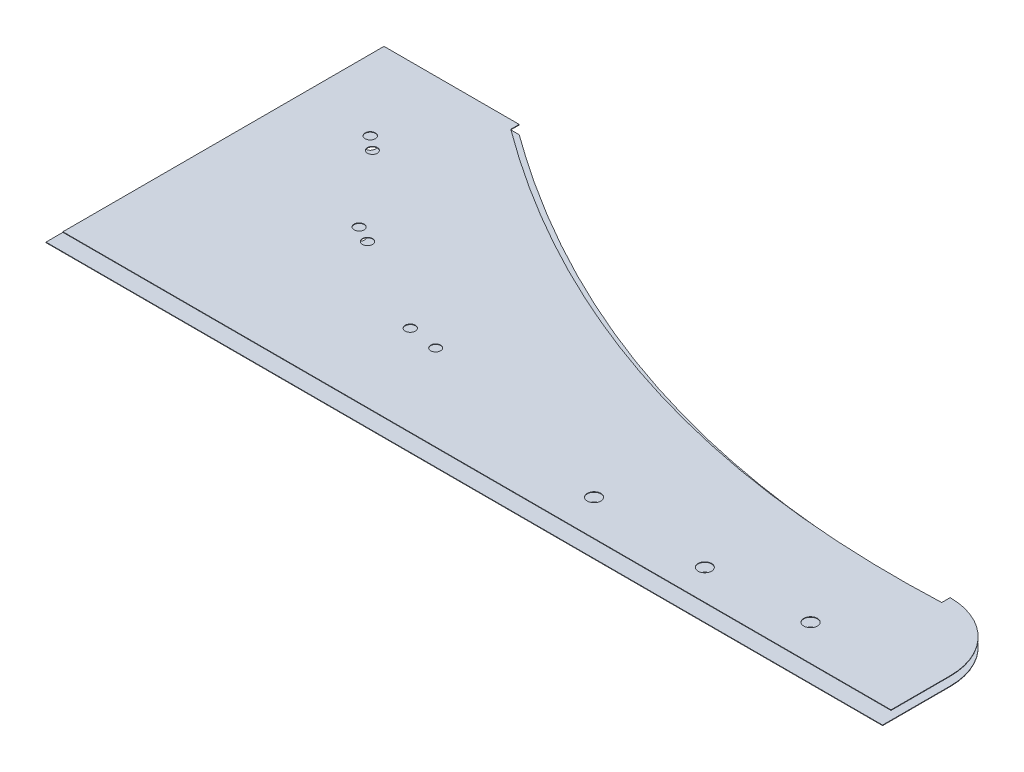
ISO-10303-21;
HEADER;
FILE_DESCRIPTION(('STEP AP214'),'2;1');
FILE_NAME('part.step','',(''),(''),'','','');
FILE_SCHEMA(('AUTOMOTIVE_DESIGN { 1 0 10303 214 1 1 1 1 }'));
ENDSEC;
DATA;
#1=APPLICATION_CONTEXT('core data for automotive mechanical design processes');
#2=APPLICATION_PROTOCOL_DEFINITION('international standard','automotive_design',2000,#1);
#3=PRODUCT_CONTEXT('',#1,'mechanical');
#4=PRODUCT('Part','Part','',(#3));
#5=PRODUCT_RELATED_PRODUCT_CATEGORY('part','',(#4));
#6=PRODUCT_DEFINITION_FORMATION('','',#4);
#7=PRODUCT_DEFINITION_CONTEXT('part definition',#1,'design');
#8=PRODUCT_DEFINITION('design','',#6,#7);
#9=PRODUCT_DEFINITION_SHAPE('','',#8);
#10=(LENGTH_UNIT() NAMED_UNIT(*) SI_UNIT(.MILLI.,.METRE.));
#11=(NAMED_UNIT(*) PLANE_ANGLE_UNIT() SI_UNIT($,.RADIAN.));
#12=(NAMED_UNIT(*) SI_UNIT($,.STERADIAN.) SOLID_ANGLE_UNIT());
#13=UNCERTAINTY_MEASURE_WITH_UNIT(LENGTH_MEASURE(1.E-05),#10,'distance_accuracy_value','');
#14=(GEOMETRIC_REPRESENTATION_CONTEXT(3) GLOBAL_UNCERTAINTY_ASSIGNED_CONTEXT((#13)) GLOBAL_UNIT_ASSIGNED_CONTEXT((#10,
#11,#12)) REPRESENTATION_CONTEXT('',''));
#15=CARTESIAN_POINT('',(0.,0.,0.));
#16=DIRECTION('',(0.,0.,1.));
#17=DIRECTION('',(1.,0.,0.));
#18=AXIS2_PLACEMENT_3D('',#15,#16,#17);
#19=CARTESIAN_POINT('',(-436.202986930584,699.7,-432.681641880523));
#20=DIRECTION('',(-7.9019274698049E-10,0.,1.));
#21=DIRECTION('',(-1.,0.,-7.9019274698049E-10));
#22=AXIS2_PLACEMENT_3D('',#19,#20,#21);
#23=PLANE('',#22);
#24=DIRECTION('',(-1.,0.,-7.9019274698049E-10));
#25=VECTOR('',#24,1.);
#26=CARTESIAN_POINT('',(-436.202986930584,700.,-432.681641880523));
#27=LINE('',#26,#25);
#28=CARTESIAN_POINT('',(-436.202986838529,700.,-432.681641813376));
#29=VERTEX_POINT('',#28);
#30=CARTESIAN_POINT('',(-521.202987022629,700.,-432.681641947689));
#31=VERTEX_POINT('',#30);
#32=EDGE_CURVE('E135',#29,#31,#27,.T.);
#33=ORIENTED_EDGE('',*,*,#32,.F.);
#34=DIRECTION('',(0.,1.,0.));
#35=VECTOR('',#34,1.);
#36=CARTESIAN_POINT('',(-436.202986838529,699.7,-432.681641813376));
#37=LINE('',#36,#35);
#38=CARTESIAN_POINT('',(-436.202986838529,699.7,-432.681641813376));
#39=VERTEX_POINT('',#38);
#40=EDGE_CURVE('E134',#39,#29,#37,.T.);
#41=ORIENTED_EDGE('',*,*,#40,.F.);
#42=DIRECTION('',(-1.,0.,-7.9019274698049E-10));
#43=VECTOR('',#42,1.);
#44=CARTESIAN_POINT('',(-436.202986930584,699.7,-432.681641880523));
#45=LINE('',#44,#43);
#46=CARTESIAN_POINT('',(-521.202987022629,699.7,-432.681641947689));
#47=VERTEX_POINT('',#46);
#48=EDGE_CURVE('E170',#39,#47,#45,.T.);
#49=ORIENTED_EDGE('',*,*,#48,.T.);
#50=DIRECTION('',(0.,1.,0.));
#51=VECTOR('',#50,1.);
#52=CARTESIAN_POINT('',(-521.202987022629,699.7,-432.681641947689));
#53=LINE('',#52,#51);
#54=EDGE_CURVE('E12',#47,#31,#53,.T.);
#55=ORIENTED_EDGE('',*,*,#54,.T.);
#56=EDGE_LOOP('',(#33,#41,#49,#55));
#57=FACE_BOUND('',#56,.T.);
#58=ADVANCED_FACE('F47',(#57),#23,.F.);
#59=CARTESIAN_POINT('',(-521.202987022629,699.7,-432.681641947689));
#60=DIRECTION('',(1.,0.,0.));
#61=DIRECTION('',(0.,0.,1.));
#62=AXIS2_PLACEMENT_3D('',#59,#60,#61);
#63=PLANE('',#62);
#64=DIRECTION('',(0.,0.,1.));
#65=VECTOR('',#64,1.);
#66=CARTESIAN_POINT('',(-521.202987022629,700.,-432.681641947689));
#67=LINE('',#66,#65);
#68=CARTESIAN_POINT('',(-521.202987022629,700.,-237.681641947689));
#69=VERTEX_POINT('',#68);
#70=EDGE_CURVE('E163',#31,#69,#67,.T.);
#71=ORIENTED_EDGE('',*,*,#70,.F.);
#72=ORIENTED_EDGE('',*,*,#54,.F.);
#73=DIRECTION('',(0.,0.,1.));
#74=VECTOR('',#73,1.);
#75=CARTESIAN_POINT('',(-521.202987022629,699.7,-432.681641947689));
#76=LINE('',#75,#74);
#77=CARTESIAN_POINT('',(-521.202987022629,699.7,-237.681641947689));
#78=VERTEX_POINT('',#77);
#79=EDGE_CURVE('E97',#47,#78,#76,.T.);
#80=ORIENTED_EDGE('',*,*,#79,.T.);
#81=DIRECTION('',(0.,1.,0.));
#82=VECTOR('',#81,1.);
#83=CARTESIAN_POINT('',(-521.202987022629,699.7,-237.681641947689));
#84=LINE('',#83,#82);
#85=EDGE_CURVE('E56',#78,#69,#84,.T.);
#86=ORIENTED_EDGE('',*,*,#85,.T.);
#87=EDGE_LOOP('',(#71,#72,#80,#86));
#88=FACE_BOUND('',#87,.T.);
#89=ADVANCED_FACE('F153',(#88),#63,.F.);
#90=CARTESIAN_POINT('',(-521.202987022629,699.7,-237.681641947689));
#91=DIRECTION('',(0.,0.,-1.));
#92=DIRECTION('',(1.,0.,0.));
#93=AXIS2_PLACEMENT_3D('',#90,#91,#92);
#94=PLANE('',#93);
#95=DIRECTION('',(1.,0.,0.));
#96=VECTOR('',#95,1.);
#97=CARTESIAN_POINT('',(-521.202987022629,700.,-237.681641947689));
#98=LINE('',#97,#96);
#99=CARTESIAN_POINT('',(-26.2029870226295,700.,-237.681641947689));
#100=VERTEX_POINT('',#99);
#101=EDGE_CURVE('E167',#69,#100,#98,.T.);
#102=ORIENTED_EDGE('',*,*,#101,.F.);
#103=ORIENTED_EDGE('',*,*,#85,.F.);
#104=DIRECTION('',(1.,0.,0.));
#105=VECTOR('',#104,1.);
#106=CARTESIAN_POINT('',(-521.202987022629,699.7,-237.681641947689));
#107=LINE('',#106,#105);
#108=CARTESIAN_POINT('',(-26.2029870226295,699.7,-237.681641947689));
#109=VERTEX_POINT('',#108);
#110=EDGE_CURVE('E125',#78,#109,#107,.T.);
#111=ORIENTED_EDGE('',*,*,#110,.T.);
#112=DIRECTION('',(0.,1.,0.));
#113=VECTOR('',#112,1.);
#114=CARTESIAN_POINT('',(-26.2029870226295,699.7,-237.681641947689));
#115=LINE('',#114,#113);
#116=EDGE_CURVE('E119',#109,#100,#115,.T.);
#117=ORIENTED_EDGE('',*,*,#116,.T.);
#118=EDGE_LOOP('',(#102,#103,#111,#117));
#119=FACE_BOUND('',#118,.T.);
#120=ADVANCED_FACE('F151',(#119),#94,.F.);
#121=CARTESIAN_POINT('',(-26.2029870226295,699.7,-237.681641947689));
#122=DIRECTION('',(-1.,0.,0.));
#123=DIRECTION('',(0.,0.,-1.));
#124=AXIS2_PLACEMENT_3D('',#121,#122,#123);
#125=PLANE('',#124);
#126=DIRECTION('',(0.,0.,-1.));
#127=VECTOR('',#126,1.);
#128=CARTESIAN_POINT('',(-26.2029870226295,700.,-237.681641947689));
#129=LINE('',#128,#127);
#130=CARTESIAN_POINT('',(-26.2029870226294,700.,-277.681641947689));
#131=VERTEX_POINT('',#130);
#132=EDGE_CURVE('E212',#100,#131,#129,.T.);
#133=ORIENTED_EDGE('',*,*,#132,.F.);
#134=ORIENTED_EDGE('',*,*,#116,.F.);
#135=DIRECTION('',(0.,0.,-1.));
#136=VECTOR('',#135,1.);
#137=CARTESIAN_POINT('',(-26.2029870226295,699.7,-237.681641947689));
#138=LINE('',#137,#136);
#139=CARTESIAN_POINT('',(-26.2029870226294,699.7,-277.681641947689));
#140=VERTEX_POINT('',#139);
#141=EDGE_CURVE('E109',#109,#140,#138,.T.);
#142=ORIENTED_EDGE('',*,*,#141,.T.);
#143=DIRECTION('',(0.,1.,0.));
#144=VECTOR('',#143,1.);
#145=CARTESIAN_POINT('',(-26.2029870226294,699.7,-277.681641947689));
#146=LINE('',#145,#144);
#147=EDGE_CURVE('E114',#140,#131,#146,.T.);
#148=ORIENTED_EDGE('',*,*,#147,.T.);
#149=EDGE_LOOP('',(#133,#134,#142,#148));
#150=FACE_BOUND('',#149,.T.);
#151=ADVANCED_FACE('F122',(#150),#125,.F.);
#152=CARTESIAN_POINT('',(-66.2029870226294,699.7,-277.681641947689));
#153=DIRECTION('',(0.,1.,0.));
#154=DIRECTION('',(0.,0.,-1.));
#155=AXIS2_PLACEMENT_3D('',#152,#153,#154);
#156=CYLINDRICAL_SURFACE('',#155,40.);
#157=CARTESIAN_POINT('',(-66.2029870226294,700.,-277.681641947689));
#158=DIRECTION('',(0.,1.,0.));
#159=DIRECTION('',(0.,0.,1.));
#160=AXIS2_PLACEMENT_3D('',#157,#158,#159);
#161=CIRCLE('',#160,40.);
#162=CARTESIAN_POINT('',(-66.2029870226294,700.,-317.681641947689));
#163=VERTEX_POINT('',#162);
#164=EDGE_CURVE('E116',#131,#163,#161,.T.);
#165=ORIENTED_EDGE('',*,*,#164,.F.);
#166=ORIENTED_EDGE('',*,*,#147,.F.);
#167=CARTESIAN_POINT('',(-66.2029870226294,699.7,-277.681641947689));
#168=DIRECTION('',(0.,1.,0.));
#169=DIRECTION('',(0.,0.,1.));
#170=AXIS2_PLACEMENT_3D('',#167,#168,#169);
#171=CIRCLE('',#170,40.);
#172=CARTESIAN_POINT('',(-66.2029870226294,699.7,-317.681641947689));
#173=VERTEX_POINT('',#172);
#174=EDGE_CURVE('E105',#140,#173,#171,.T.);
#175=ORIENTED_EDGE('',*,*,#174,.T.);
#176=DIRECTION('',(0.,1.,0.));
#177=VECTOR('',#176,1.);
#178=CARTESIAN_POINT('',(-66.2029870226294,699.7,-317.681641947689));
#179=LINE('',#178,#177);
#180=EDGE_CURVE('E120',#173,#163,#179,.T.);
#181=ORIENTED_EDGE('',*,*,#180,.T.);
#182=EDGE_LOOP('',(#165,#166,#175,#181));
#183=FACE_BOUND('',#182,.T.);
#184=ADVANCED_FACE('F115',(#183),#156,.T.);
#185=CARTESIAN_POINT('',(243907.016921862,699.7,-970636.245329769));
#186=CARTESIAN_POINT('',(-212077.093758222,699.7,976969.386915229));
#187=CARTESIAN_POINT('',(179399.129928416,699.7,-984620.675822955));
#188=B_SPLINE_CURVE_WITH_KNOTS('',2,(#185,#186,#187),.UNSPECIFIED.,.F.,.F.,(3,3),(0.,1.),.UNSPECIFIED.);
#189=DIRECTION('',(0.,1.,0.));
#190=VECTOR('',#189,1.);
#191=SURFACE_OF_LINEAR_EXTRUSION('',#188,#190);
#192=CARTESIAN_POINT('',(243907.016921862,700.,-970636.245329769));
#193=CARTESIAN_POINT('',(-212077.093758222,700.,976969.386915229));
#194=CARTESIAN_POINT('',(179399.129928416,700.,-984620.675822955));
#195=B_SPLINE_CURVE_WITH_KNOTS('',2,(#192,#193,#194),.UNSPECIFIED.,.F.,.F.,(3,3),(0.,1.),.UNSPECIFIED.);
#196=EDGE_CURVE('E85',#163,#29,#195,.T.);
#197=ORIENTED_EDGE('',*,*,#196,.F.);
#198=ORIENTED_EDGE('',*,*,#180,.F.);
#199=EDGE_CURVE('E65',#173,#39,#188,.T.);
#200=ORIENTED_EDGE('',*,*,#199,.T.);
#201=ORIENTED_EDGE('',*,*,#40,.T.);
#202=EDGE_LOOP('',(#197,#198,#200,#201));
#203=FACE_BOUND('',#202,.T.);
#204=ADVANCED_FACE('F141',(#203),#191,.T.);
#205=CARTESIAN_POINT('',(-66.2029870226294,699.7,-277.681641947689));
#206=DIRECTION('',(0.,-1.,0.));
#207=DIRECTION('',(0.,0.,1.));
#208=AXIS2_PLACEMENT_3D('',#205,#206,#207);
#209=PLANE('',#208);
#210=CARTESIAN_POINT('',(-94.9095215443751,699.7,-263.802212935845));
#211=DIRECTION('',(0.,1.,0.));
#212=DIRECTION('',(0.,0.,1.));
#213=AXIS2_PLACEMENT_3D('',#210,#211,#212);
#214=CIRCLE('',#213,3.99999999999999);
#215=CARTESIAN_POINT('',(-94.9095215443751,699.7,-259.802212935845));
#216=VERTEX_POINT('',#215);
#217=EDGE_CURVE('E199',#216,#216,#214,.T.);
#218=ORIENTED_EDGE('',*,*,#217,.T.);
#219=EDGE_LOOP('',(#218));
#220=FACE_BOUND('',#219,.T.);
#221=CARTESIAN_POINT('',(-154.344703344319,699.7,-260.643821632466));
#222=DIRECTION('',(0.,1.,0.));
#223=DIRECTION('',(0.,0.,1.));
#224=AXIS2_PLACEMENT_3D('',#221,#222,#223);
#225=CIRCLE('',#224,4.00000000000002);
#226=CARTESIAN_POINT('',(-154.344703344319,699.7,-256.643821632466));
#227=VERTEX_POINT('',#226);
#228=EDGE_CURVE('E237',#227,#227,#225,.T.);
#229=ORIENTED_EDGE('',*,*,#228,.T.);
#230=EDGE_LOOP('',(#229));
#231=FACE_BOUND('',#230,.T.);
#232=CARTESIAN_POINT('',(-223.024834580686,699.7,-263.802212935845));
#233=DIRECTION('',(0.,1.,0.));
#234=DIRECTION('',(0.,0.,1.));
#235=AXIS2_PLACEMENT_3D('',#232,#233,#234);
#236=CIRCLE('',#235,4.00000000000002);
#237=CARTESIAN_POINT('',(-223.024834580686,699.7,-259.802212935845));
#238=VERTEX_POINT('',#237);
#239=EDGE_CURVE('E234',#238,#238,#236,.T.);
#240=ORIENTED_EDGE('',*,*,#239,.T.);
#241=EDGE_LOOP('',(#240));
#242=FACE_BOUND('',#241,.T.);
#243=CARTESIAN_POINT('',(-346.372819063942,699.7,-293.429327819401));
#244=DIRECTION('',(0.,1.,0.));
#245=DIRECTION('',(0.,0.,1.));
#246=AXIS2_PLACEMENT_3D('',#243,#244,#245);
#247=CIRCLE('',#246,2.94464183129883);
#248=CARTESIAN_POINT('',(-346.372819063942,699.7,-290.484685988103));
#249=VERTEX_POINT('',#248);
#250=EDGE_CURVE('E231',#249,#249,#247,.T.);
#251=ORIENTED_EDGE('',*,*,#250,.T.);
#252=EDGE_LOOP('',(#251));
#253=FACE_BOUND('',#252,.T.);
#254=CARTESIAN_POINT('',(-364.017672886245,699.7,-296.048587357132));
#255=DIRECTION('',(0.,1.,0.));
#256=DIRECTION('',(0.,0.,1.));
#257=AXIS2_PLACEMENT_3D('',#254,#255,#256);
#258=CIRCLE('',#257,3.02057651298697);
#259=CARTESIAN_POINT('',(-364.017672886245,699.7,-293.028010844145));
#260=VERTEX_POINT('',#259);
#261=EDGE_CURVE('E228',#260,#260,#258,.T.);
#262=ORIENTED_EDGE('',*,*,#261,.T.);
#263=EDGE_LOOP('',(#262));
#264=FACE_BOUND('',#263,.T.);
#265=CARTESIAN_POINT('',(-421.082774625095,699.7,-327.80979347949));
#266=DIRECTION('',(0.,1.,0.));
#267=DIRECTION('',(0.,0.,1.));
#268=AXIS2_PLACEMENT_3D('',#265,#266,#267);
#269=CIRCLE('',#268,3.01217780293913);
#270=CARTESIAN_POINT('',(-421.082774625095,699.7,-324.797615676551));
#271=VERTEX_POINT('',#270);
#272=EDGE_CURVE('E225',#271,#271,#269,.T.);
#273=ORIENTED_EDGE('',*,*,#272,.T.);
#274=EDGE_LOOP('',(#273));
#275=FACE_BOUND('',#274,.T.);
#276=CARTESIAN_POINT('',(-431.013382426237,699.7,-332.77130718692));
#277=DIRECTION('',(0.,1.,0.));
#278=DIRECTION('',(0.,0.,1.));
#279=AXIS2_PLACEMENT_3D('',#276,#277,#278);
#280=CIRCLE('',#279,2.96969460121312);
#281=CARTESIAN_POINT('',(-431.013382426237,699.7,-329.801612585707));
#282=VERTEX_POINT('',#281);
#283=EDGE_CURVE('E222',#282,#282,#280,.T.);
#284=ORIENTED_EDGE('',*,*,#283,.T.);
#285=EDGE_LOOP('',(#284));
#286=FACE_BOUND('',#285,.T.);
#287=CARTESIAN_POINT('',(-466.317801150332,699.7,-375.92365410933));
#288=DIRECTION('',(0.,1.,0.));
#289=DIRECTION('',(0.,0.,1.));
#290=AXIS2_PLACEMENT_3D('',#287,#288,#289);
#291=CIRCLE('',#290,2.92635446588858);
#292=CARTESIAN_POINT('',(-466.317801150332,699.7,-372.997299643442));
#293=VERTEX_POINT('',#292);
#294=EDGE_CURVE('E219',#293,#293,#291,.T.);
#295=ORIENTED_EDGE('',*,*,#294,.T.);
#296=EDGE_LOOP('',(#295));
#297=FACE_BOUND('',#296,.T.);
#298=CARTESIAN_POINT('',(-474.449169572246,699.7,-382.793687092254));
#299=DIRECTION('',(0.,1.,0.));
#300=DIRECTION('',(0.,0.,1.));
#301=AXIS2_PLACEMENT_3D('',#298,#299,#300);
#302=CIRCLE('',#301,3.02232510648865);
#303=CARTESIAN_POINT('',(-474.449169572246,699.7,-379.771361985765));
#304=VERTEX_POINT('',#303);
#305=EDGE_CURVE('E216',#304,#304,#302,.T.);
#306=ORIENTED_EDGE('',*,*,#305,.T.);
#307=EDGE_LOOP('',(#306));
#308=FACE_BOUND('',#307,.T.);
#309=ORIENTED_EDGE('',*,*,#48,.F.);
#310=ORIENTED_EDGE('',*,*,#199,.F.);
#311=ORIENTED_EDGE('',*,*,#174,.F.);
#312=ORIENTED_EDGE('',*,*,#141,.F.);
#313=ORIENTED_EDGE('',*,*,#110,.F.);
#314=ORIENTED_EDGE('',*,*,#79,.F.);
#315=EDGE_LOOP('',(#309,#310,#311,#312,#313,#314));
#316=FACE_BOUND('',#315,.T.);
#317=ADVANCED_FACE('F107',(#220,#231,#242,#253,#264,#275,#286,#297,#308,#316),#209,.T.);
#318=CARTESIAN_POINT('',(-66.2029870226294,700.,-277.681641947689));
#319=DIRECTION('',(0.,-1.,0.));
#320=DIRECTION('',(0.,0.,1.));
#321=AXIS2_PLACEMENT_3D('',#318,#319,#320);
#322=PLANE('',#321);
#323=CARTESIAN_POINT('',(-94.9095215443751,700.,-263.802212935845));
#324=DIRECTION('',(0.,1.,0.));
#325=DIRECTION('',(0.,0.,1.));
#326=AXIS2_PLACEMENT_3D('',#323,#324,#325);
#327=CIRCLE('',#326,3.99999999999999);
#328=CARTESIAN_POINT('',(-94.9095215443751,700.,-259.802212935845));
#329=VERTEX_POINT('',#328);
#330=EDGE_CURVE('E50',#329,#329,#327,.T.);
#331=ORIENTED_EDGE('',*,*,#330,.F.);
#332=EDGE_LOOP('',(#331));
#333=FACE_BOUND('',#332,.T.);
#334=CARTESIAN_POINT('',(-154.344703344319,700.,-260.643821632466));
#335=DIRECTION('',(0.,1.,0.));
#336=DIRECTION('',(0.,0.,1.));
#337=AXIS2_PLACEMENT_3D('',#334,#335,#336);
#338=CIRCLE('',#337,4.00000000000002);
#339=CARTESIAN_POINT('',(-154.344703344319,700.,-256.643821632466));
#340=VERTEX_POINT('',#339);
#341=EDGE_CURVE('E172',#340,#340,#338,.T.);
#342=ORIENTED_EDGE('',*,*,#341,.F.);
#343=EDGE_LOOP('',(#342));
#344=FACE_BOUND('',#343,.T.);
#345=CARTESIAN_POINT('',(-223.024834580686,700.,-263.802212935845));
#346=DIRECTION('',(0.,1.,0.));
#347=DIRECTION('',(0.,0.,1.));
#348=AXIS2_PLACEMENT_3D('',#345,#346,#347);
#349=CIRCLE('',#348,4.00000000000002);
#350=CARTESIAN_POINT('',(-223.024834580686,700.,-259.802212935845));
#351=VERTEX_POINT('',#350);
#352=EDGE_CURVE('E176',#351,#351,#349,.T.);
#353=ORIENTED_EDGE('',*,*,#352,.F.);
#354=EDGE_LOOP('',(#353));
#355=FACE_BOUND('',#354,.T.);
#356=CARTESIAN_POINT('',(-346.372819063942,700.,-293.429327819401));
#357=DIRECTION('',(0.,1.,0.));
#358=DIRECTION('',(0.,0.,1.));
#359=AXIS2_PLACEMENT_3D('',#356,#357,#358);
#360=CIRCLE('',#359,2.94464183129883);
#361=CARTESIAN_POINT('',(-346.372819063942,700.,-290.484685988103));
#362=VERTEX_POINT('',#361);
#363=EDGE_CURVE('E180',#362,#362,#360,.T.);
#364=ORIENTED_EDGE('',*,*,#363,.F.);
#365=EDGE_LOOP('',(#364));
#366=FACE_BOUND('',#365,.T.);
#367=CARTESIAN_POINT('',(-364.017672886245,700.,-296.048587357132));
#368=DIRECTION('',(0.,1.,0.));
#369=DIRECTION('',(0.,0.,1.));
#370=AXIS2_PLACEMENT_3D('',#367,#368,#369);
#371=CIRCLE('',#370,3.02057651298697);
#372=CARTESIAN_POINT('',(-364.017672886245,700.,-293.028010844145));
#373=VERTEX_POINT('',#372);
#374=EDGE_CURVE('E185',#373,#373,#371,.T.);
#375=ORIENTED_EDGE('',*,*,#374,.F.);
#376=EDGE_LOOP('',(#375));
#377=FACE_BOUND('',#376,.T.);
#378=CARTESIAN_POINT('',(-421.082774625095,700.,-327.80979347949));
#379=DIRECTION('',(0.,1.,0.));
#380=DIRECTION('',(0.,0.,1.));
#381=AXIS2_PLACEMENT_3D('',#378,#379,#380);
#382=CIRCLE('',#381,3.01217780293913);
#383=CARTESIAN_POINT('',(-421.082774625095,700.,-324.797615676551));
#384=VERTEX_POINT('',#383);
#385=EDGE_CURVE('E188',#384,#384,#382,.T.);
#386=ORIENTED_EDGE('',*,*,#385,.F.);
#387=EDGE_LOOP('',(#386));
#388=FACE_BOUND('',#387,.T.);
#389=CARTESIAN_POINT('',(-431.013382426237,700.,-332.77130718692));
#390=DIRECTION('',(0.,1.,0.));
#391=DIRECTION('',(0.,0.,1.));
#392=AXIS2_PLACEMENT_3D('',#389,#390,#391);
#393=CIRCLE('',#392,2.96969460121312);
#394=CARTESIAN_POINT('',(-431.013382426237,700.,-329.801612585707));
#395=VERTEX_POINT('',#394);
#396=EDGE_CURVE('E191',#395,#395,#393,.T.);
#397=ORIENTED_EDGE('',*,*,#396,.F.);
#398=EDGE_LOOP('',(#397));
#399=FACE_BOUND('',#398,.T.);
#400=CARTESIAN_POINT('',(-466.317801150332,700.,-375.92365410933));
#401=DIRECTION('',(0.,1.,0.));
#402=DIRECTION('',(0.,0.,1.));
#403=AXIS2_PLACEMENT_3D('',#400,#401,#402);
#404=CIRCLE('',#403,2.92635446588858);
#405=CARTESIAN_POINT('',(-466.317801150332,700.,-372.997299643442));
#406=VERTEX_POINT('',#405);
#407=EDGE_CURVE('E194',#406,#406,#404,.T.);
#408=ORIENTED_EDGE('',*,*,#407,.F.);
#409=EDGE_LOOP('',(#408));
#410=FACE_BOUND('',#409,.T.);
#411=CARTESIAN_POINT('',(-474.449169572246,700.,-382.793687092254));
#412=DIRECTION('',(0.,1.,0.));
#413=DIRECTION('',(0.,0.,1.));
#414=AXIS2_PLACEMENT_3D('',#411,#412,#413);
#415=CIRCLE('',#414,3.02232510648865);
#416=CARTESIAN_POINT('',(-474.449169572246,700.,-379.771361985765));
#417=VERTEX_POINT('',#416);
#418=EDGE_CURVE('E197',#417,#417,#415,.T.);
#419=ORIENTED_EDGE('',*,*,#418,.F.);
#420=EDGE_LOOP('',(#419));
#421=FACE_BOUND('',#420,.T.);
#422=ORIENTED_EDGE('',*,*,#32,.T.);
#423=ORIENTED_EDGE('',*,*,#70,.T.);
#424=ORIENTED_EDGE('',*,*,#101,.T.);
#425=ORIENTED_EDGE('',*,*,#132,.T.);
#426=ORIENTED_EDGE('',*,*,#164,.T.);
#427=ORIENTED_EDGE('',*,*,#196,.T.);
#428=EDGE_LOOP('',(#422,#423,#424,#425,#426,#427));
#429=FACE_BOUND('',#428,.T.);
#430=ADVANCED_FACE('F145',(#333,#344,#355,#366,#377,#388,#399,#410,#421,#429),#322,.F.);
#431=CARTESIAN_POINT('',(-474.449169572246,719.7,-382.793687092254));
#432=DIRECTION('',(0.,-1.,0.));
#433=DIRECTION('',(0.,0.,1.));
#434=AXIS2_PLACEMENT_3D('',#431,#432,#433);
#435=CYLINDRICAL_SURFACE('',#434,3.02232510648865);
#436=ORIENTED_EDGE('',*,*,#305,.F.);
#437=EDGE_LOOP('',(#436));
#438=FACE_BOUND('',#437,.T.);
#439=ORIENTED_EDGE('',*,*,#418,.T.);
#440=EDGE_LOOP('',(#439));
#441=FACE_BOUND('',#440,.T.);
#442=ADVANCED_FACE('F278',(#438,#441),#435,.F.);
#443=CARTESIAN_POINT('',(-466.317801150332,719.7,-375.92365410933));
#444=DIRECTION('',(0.,-1.,0.));
#445=DIRECTION('',(0.,0.,1.));
#446=AXIS2_PLACEMENT_3D('',#443,#444,#445);
#447=CYLINDRICAL_SURFACE('',#446,2.92635446588858);
#448=ORIENTED_EDGE('',*,*,#294,.F.);
#449=EDGE_LOOP('',(#448));
#450=FACE_BOUND('',#449,.T.);
#451=ORIENTED_EDGE('',*,*,#407,.T.);
#452=EDGE_LOOP('',(#451));
#453=FACE_BOUND('',#452,.T.);
#454=ADVANCED_FACE('F274',(#450,#453),#447,.F.);
#455=CARTESIAN_POINT('',(-431.013382426237,719.7,-332.77130718692));
#456=DIRECTION('',(0.,-1.,0.));
#457=DIRECTION('',(0.,0.,1.));
#458=AXIS2_PLACEMENT_3D('',#455,#456,#457);
#459=CYLINDRICAL_SURFACE('',#458,2.96969460121312);
#460=ORIENTED_EDGE('',*,*,#283,.F.);
#461=EDGE_LOOP('',(#460));
#462=FACE_BOUND('',#461,.T.);
#463=ORIENTED_EDGE('',*,*,#396,.T.);
#464=EDGE_LOOP('',(#463));
#465=FACE_BOUND('',#464,.T.);
#466=ADVANCED_FACE('F270',(#462,#465),#459,.F.);
#467=CARTESIAN_POINT('',(-421.082774625095,719.7,-327.80979347949));
#468=DIRECTION('',(0.,-1.,0.));
#469=DIRECTION('',(0.,0.,1.));
#470=AXIS2_PLACEMENT_3D('',#467,#468,#469);
#471=CYLINDRICAL_SURFACE('',#470,3.01217780293913);
#472=ORIENTED_EDGE('',*,*,#272,.F.);
#473=EDGE_LOOP('',(#472));
#474=FACE_BOUND('',#473,.T.);
#475=ORIENTED_EDGE('',*,*,#385,.T.);
#476=EDGE_LOOP('',(#475));
#477=FACE_BOUND('',#476,.T.);
#478=ADVANCED_FACE('F266',(#474,#477),#471,.F.);
#479=CARTESIAN_POINT('',(-364.017672886245,719.7,-296.048587357132));
#480=DIRECTION('',(0.,-1.,0.));
#481=DIRECTION('',(0.,0.,1.));
#482=AXIS2_PLACEMENT_3D('',#479,#480,#481);
#483=CYLINDRICAL_SURFACE('',#482,3.02057651298697);
#484=ORIENTED_EDGE('',*,*,#261,.F.);
#485=EDGE_LOOP('',(#484));
#486=FACE_BOUND('',#485,.T.);
#487=ORIENTED_EDGE('',*,*,#374,.T.);
#488=EDGE_LOOP('',(#487));
#489=FACE_BOUND('',#488,.T.);
#490=ADVANCED_FACE('F262',(#486,#489),#483,.F.);
#491=CARTESIAN_POINT('',(-346.372819063942,719.7,-293.429327819401));
#492=DIRECTION('',(0.,-1.,0.));
#493=DIRECTION('',(0.,0.,1.));
#494=AXIS2_PLACEMENT_3D('',#491,#492,#493);
#495=CYLINDRICAL_SURFACE('',#494,2.94464183129883);
#496=ORIENTED_EDGE('',*,*,#250,.F.);
#497=EDGE_LOOP('',(#496));
#498=FACE_BOUND('',#497,.T.);
#499=ORIENTED_EDGE('',*,*,#363,.T.);
#500=EDGE_LOOP('',(#499));
#501=FACE_BOUND('',#500,.T.);
#502=ADVANCED_FACE('F258',(#498,#501),#495,.F.);
#503=CARTESIAN_POINT('',(-223.024834580686,719.7,-263.802212935845));
#504=DIRECTION('',(0.,-1.,0.));
#505=DIRECTION('',(0.,0.,1.));
#506=AXIS2_PLACEMENT_3D('',#503,#504,#505);
#507=CYLINDRICAL_SURFACE('',#506,4.00000000000002);
#508=ORIENTED_EDGE('',*,*,#239,.F.);
#509=EDGE_LOOP('',(#508));
#510=FACE_BOUND('',#509,.T.);
#511=ORIENTED_EDGE('',*,*,#352,.T.);
#512=EDGE_LOOP('',(#511));
#513=FACE_BOUND('',#512,.T.);
#514=ADVANCED_FACE('F252',(#510,#513),#507,.F.);
#515=CARTESIAN_POINT('',(-154.344703344319,719.7,-260.643821632466));
#516=DIRECTION('',(0.,-1.,0.));
#517=DIRECTION('',(0.,0.,1.));
#518=AXIS2_PLACEMENT_3D('',#515,#516,#517);
#519=CYLINDRICAL_SURFACE('',#518,4.00000000000002);
#520=ORIENTED_EDGE('',*,*,#228,.F.);
#521=EDGE_LOOP('',(#520));
#522=FACE_BOUND('',#521,.T.);
#523=ORIENTED_EDGE('',*,*,#341,.T.);
#524=EDGE_LOOP('',(#523));
#525=FACE_BOUND('',#524,.T.);
#526=ADVANCED_FACE('F247',(#522,#525),#519,.F.);
#527=CARTESIAN_POINT('',(-94.9095215443751,719.7,-263.802212935845));
#528=DIRECTION('',(0.,-1.,0.));
#529=DIRECTION('',(0.,0.,1.));
#530=AXIS2_PLACEMENT_3D('',#527,#528,#529);
#531=CYLINDRICAL_SURFACE('',#530,3.99999999999999);
#532=ORIENTED_EDGE('',*,*,#217,.F.);
#533=EDGE_LOOP('',(#532));
#534=FACE_BOUND('',#533,.T.);
#535=ORIENTED_EDGE('',*,*,#330,.T.);
#536=EDGE_LOOP('',(#535));
#537=FACE_BOUND('',#536,.T.);
#538=ADVANCED_FACE('F245',(#534,#537),#531,.F.);
#539=CLOSED_SHELL('',(#58,#89,#120,#151,#184,#204,#317,#430,#442,#454,#466,#478,#490,#502,#514,
#526,#538));
#540=MANIFOLD_SOLID_BREP('B2',#539);
#541=CARTESIAN_POINT('',(221133.268668467,705.3,-976081.243658897));
#542=CARTESIAN_POINT('',(-253607.150543159,705.3,967038.901584156));
#543=CARTESIAN_POINT('',(285136.69602359,705.3,-959317.615852084));
#544=B_SPLINE_CURVE_WITH_KNOTS('',2,(#541,#542,#543),.UNSPECIFIED.,.F.,.F.,(3,3),(0.,1.),.UNSPECIFIED.);
#545=DIRECTION('',(0.,-1.,0.));
#546=VECTOR('',#545,1.);
#547=SURFACE_OF_LINEAR_EXTRUSION('',#544,#546);
#548=CARTESIAN_POINT('',(221133.268668467,705.,-976081.243658897));
#549=CARTESIAN_POINT('',(-253607.150543159,705.,967038.901584156));
#550=CARTESIAN_POINT('',(285136.69602359,705.,-959317.615852084));
#551=B_SPLINE_CURVE_WITH_KNOTS('',2,(#548,#549,#550),.UNSPECIFIED.,.F.,.F.,(3,3),(0.,1.),.UNSPECIFIED.);
#552=CARTESIAN_POINT('',(-436.20298693406,705.,-427.681641882333));
#553=VERTEX_POINT('',#552);
#554=CARTESIAN_POINT('',(-66.2029870252319,705.,-312.68164194759));
#555=VERTEX_POINT('',#554);
#556=EDGE_CURVE('E522',#553,#555,#551,.T.);
#557=ORIENTED_EDGE('',*,*,#556,.F.);
#558=DIRECTION('',(0.,-1.,0.));
#559=VECTOR('',#558,1.);
#560=CARTESIAN_POINT('',(-436.20298693406,705.3,-427.681641882333));
#561=LINE('',#560,#559);
#562=CARTESIAN_POINT('',(-436.20298693406,705.3,-427.681641882333));
#563=VERTEX_POINT('',#562);
#564=EDGE_CURVE('E521',#563,#553,#561,.T.);
#565=ORIENTED_EDGE('',*,*,#564,.F.);
#566=CARTESIAN_POINT('',(-66.2029870252319,705.3,-312.68164194759));
#567=VERTEX_POINT('',#566);
#568=EDGE_CURVE('E546',#563,#567,#544,.T.);
#569=ORIENTED_EDGE('',*,*,#568,.T.);
#570=DIRECTION('',(0.,-1.,0.));
#571=VECTOR('',#570,1.);
#572=CARTESIAN_POINT('',(-66.2029870252319,705.3,-312.68164194759));
#573=LINE('',#572,#571);
#574=EDGE_CURVE('E45',#567,#555,#573,.T.);
#575=ORIENTED_EDGE('',*,*,#574,.T.);
#576=EDGE_LOOP('',(#557,#565,#569,#575));
#577=FACE_BOUND('',#576,.T.);
#578=ADVANCED_FACE('F423',(#577),#547,.T.);
#579=CARTESIAN_POINT('',(-66.2029870252319,705.3,-312.68164194759));
#580=DIRECTION('',(1.,0.,5.20483656164187E-10));
#581=DIRECTION('',(-5.20483656164187E-10,0.,1.));
#582=AXIS2_PLACEMENT_3D('',#579,#580,#581);
#583=PLANE('',#582);
#584=DIRECTION('',(5.20483656164187E-10,0.,-1.));
#585=VECTOR('',#584,1.);
#586=CARTESIAN_POINT('',(-66.2029870252319,705.,-312.68164194759));
#587=LINE('',#586,#585);
#588=CARTESIAN_POINT('',(-66.2029870226294,705.,-317.681641947689));
#589=VERTEX_POINT('',#588);
#590=EDGE_CURVE('E526',#555,#589,#587,.T.);
#591=ORIENTED_EDGE('',*,*,#590,.F.);
#592=ORIENTED_EDGE('',*,*,#574,.F.);
#593=DIRECTION('',(5.20483656164187E-10,0.,-1.));
#594=VECTOR('',#593,1.);
#595=CARTESIAN_POINT('',(-66.2029870252319,705.3,-312.68164194759));
#596=LINE('',#595,#594);
#597=CARTESIAN_POINT('',(-66.2029870226294,705.3,-317.681641947689));
#598=VERTEX_POINT('',#597);
#599=EDGE_CURVE('E480',#567,#598,#596,.T.);
#600=ORIENTED_EDGE('',*,*,#599,.T.);
#601=DIRECTION('',(0.,-1.,0.));
#602=VECTOR('',#601,1.);
#603=CARTESIAN_POINT('',(-66.2029870226294,705.3,-317.681641947689));
#604=LINE('',#603,#602);
#605=EDGE_CURVE('E433',#598,#589,#604,.T.);
#606=ORIENTED_EDGE('',*,*,#605,.T.);
#607=EDGE_LOOP('',(#591,#592,#600,#606));
#608=FACE_BOUND('',#607,.T.);
#609=ADVANCED_FACE('F623',(#608),#583,.F.);
#610=CARTESIAN_POINT('',(-66.2029870226294,705.3,-277.681641947689));
#611=DIRECTION('',(0.,-1.,0.));
#612=DIRECTION('',(0.,0.,1.));
#613=AXIS2_PLACEMENT_3D('',#610,#611,#612);
#614=CYLINDRICAL_SURFACE('',#613,40.);
#615=CARTESIAN_POINT('',(-66.2029870226294,705.,-277.681641947689));
#616=DIRECTION('',(0.,-1.,0.));
#617=DIRECTION('',(0.,0.,-1.));
#618=AXIS2_PLACEMENT_3D('',#615,#616,#617);
#619=CIRCLE('',#618,40.);
#620=CARTESIAN_POINT('',(-26.2029870226295,705.,-277.681641947689));
#621=VERTEX_POINT('',#620);
#622=EDGE_CURVE('E533',#589,#621,#619,.T.);
#623=ORIENTED_EDGE('',*,*,#622,.F.);
#624=ORIENTED_EDGE('',*,*,#605,.F.);
#625=CARTESIAN_POINT('',(-66.2029870226294,705.3,-277.681641947689));
#626=DIRECTION('',(0.,-1.,0.));
#627=DIRECTION('',(0.,0.,-1.));
#628=AXIS2_PLACEMENT_3D('',#625,#626,#627);
#629=CIRCLE('',#628,40.);
#630=CARTESIAN_POINT('',(-26.2029870226295,705.3,-277.681641947689));
#631=VERTEX_POINT('',#630);
#632=EDGE_CURVE('E609',#598,#631,#629,.T.);
#633=ORIENTED_EDGE('',*,*,#632,.T.);
#634=DIRECTION('',(0.,-1.,0.));
#635=VECTOR('',#634,1.);
#636=CARTESIAN_POINT('',(-26.2029870226295,705.3,-277.681641947689));
#637=LINE('',#636,#635);
#638=EDGE_CURVE('E553',#631,#621,#637,.T.);
#639=ORIENTED_EDGE('',*,*,#638,.T.);
#640=EDGE_LOOP('',(#623,#624,#633,#639));
#641=FACE_BOUND('',#640,.T.);
#642=ADVANCED_FACE('F621',(#641),#614,.T.);
#643=CARTESIAN_POINT('',(-26.2029870226295,705.3,-277.681641947689));
#644=DIRECTION('',(-1.,0.,0.));
#645=DIRECTION('',(0.,0.,-1.));
#646=AXIS2_PLACEMENT_3D('',#643,#644,#645);
#647=PLANE('',#646);
#648=DIRECTION('',(0.,0.,1.));
#649=VECTOR('',#648,1.);
#650=CARTESIAN_POINT('',(-26.2029870226295,705.,-277.681641947689));
#651=LINE('',#650,#649);
#652=CARTESIAN_POINT('',(-26.2029870226295,705.,-242.681641947689));
#653=VERTEX_POINT('',#652);
#654=EDGE_CURVE('E536',#621,#653,#651,.T.);
#655=ORIENTED_EDGE('',*,*,#654,.F.);
#656=ORIENTED_EDGE('',*,*,#638,.F.);
#657=DIRECTION('',(0.,0.,1.));
#658=VECTOR('',#657,1.);
#659=CARTESIAN_POINT('',(-26.2029870226295,705.3,-277.681641947689));
#660=LINE('',#659,#658);
#661=CARTESIAN_POINT('',(-26.2029870226295,705.3,-242.681641947689));
#662=VERTEX_POINT('',#661);
#663=EDGE_CURVE('E516',#631,#662,#660,.T.);
#664=ORIENTED_EDGE('',*,*,#663,.T.);
#665=DIRECTION('',(0.,-1.,0.));
#666=VECTOR('',#665,1.);
#667=CARTESIAN_POINT('',(-26.2029870226295,705.3,-242.681641947689));
#668=LINE('',#667,#666);
#669=EDGE_CURVE('E550',#662,#653,#668,.T.);
#670=ORIENTED_EDGE('',*,*,#669,.T.);
#671=EDGE_LOOP('',(#655,#656,#664,#670));
#672=FACE_BOUND('',#671,.T.);
#673=ADVANCED_FACE('F614',(#672),#647,.F.);
#674=CARTESIAN_POINT('',(-26.2029870226295,705.3,-242.681641947689));
#675=DIRECTION('',(0.,0.,-1.));
#676=DIRECTION('',(1.,0.,0.));
#677=AXIS2_PLACEMENT_3D('',#674,#675,#676);
#678=PLANE('',#677);
#679=DIRECTION('',(-1.,0.,0.));
#680=VECTOR('',#679,1.);
#681=CARTESIAN_POINT('',(-26.2029870226295,705.,-242.681641947689));
#682=LINE('',#681,#680);
#683=CARTESIAN_POINT('',(-516.202987022629,705.,-242.681641947689));
#684=VERTEX_POINT('',#683);
#685=EDGE_CURVE('E539',#653,#684,#682,.T.);
#686=ORIENTED_EDGE('',*,*,#685,.F.);
#687=ORIENTED_EDGE('',*,*,#669,.F.);
#688=DIRECTION('',(-1.,0.,0.));
#689=VECTOR('',#688,1.);
#690=CARTESIAN_POINT('',(-26.2029870226295,705.3,-242.681641947689));
#691=LINE('',#690,#689);
#692=CARTESIAN_POINT('',(-516.202987022629,705.3,-242.681641947689));
#693=VERTEX_POINT('',#692);
#694=EDGE_CURVE('E514',#662,#693,#691,.T.);
#695=ORIENTED_EDGE('',*,*,#694,.T.);
#696=DIRECTION('',(0.,-1.,0.));
#697=VECTOR('',#696,1.);
#698=CARTESIAN_POINT('',(-516.202987022629,705.3,-242.681641947689));
#699=LINE('',#698,#697);
#700=EDGE_CURVE('E508',#693,#684,#699,.T.);
#701=ORIENTED_EDGE('',*,*,#700,.T.);
#702=EDGE_LOOP('',(#686,#687,#695,#701));
#703=FACE_BOUND('',#702,.T.);
#704=ADVANCED_FACE('F618',(#703),#678,.F.);
#705=CARTESIAN_POINT('',(-516.202987022629,705.3,-242.681641947689));
#706=DIRECTION('',(1.,0.,0.));
#707=DIRECTION('',(0.,0.,1.));
#708=AXIS2_PLACEMENT_3D('',#705,#706,#707);
#709=PLANE('',#708);
#710=DIRECTION('',(0.,0.,-1.));
#711=VECTOR('',#710,1.);
#712=CARTESIAN_POINT('',(-516.202987022629,705.,-242.681641947689));
#713=LINE('',#712,#711);
#714=CARTESIAN_POINT('',(-516.202987022629,705.,-432.681641947689));
#715=VERTEX_POINT('',#714);
#716=EDGE_CURVE('E542',#684,#715,#713,.T.);
#717=ORIENTED_EDGE('',*,*,#716,.F.);
#718=ORIENTED_EDGE('',*,*,#700,.F.);
#719=DIRECTION('',(0.,0.,-1.));
#720=VECTOR('',#719,1.);
#721=CARTESIAN_POINT('',(-516.202987022629,705.3,-242.681641947689));
#722=LINE('',#721,#720);
#723=CARTESIAN_POINT('',(-516.202987022629,705.3,-432.681641947689));
#724=VERTEX_POINT('',#723);
#725=EDGE_CURVE('E498',#693,#724,#722,.T.);
#726=ORIENTED_EDGE('',*,*,#725,.T.);
#727=DIRECTION('',(0.,-1.,0.));
#728=VECTOR('',#727,1.);
#729=CARTESIAN_POINT('',(-516.202987022629,705.3,-432.681641947689));
#730=LINE('',#729,#728);
#731=EDGE_CURVE('E503',#724,#715,#730,.T.);
#732=ORIENTED_EDGE('',*,*,#731,.T.);
#733=EDGE_LOOP('',(#717,#718,#726,#732));
#734=FACE_BOUND('',#733,.T.);
#735=ADVANCED_FACE('F511',(#734),#709,.F.);
#736=CARTESIAN_POINT('',(-516.202987022629,705.3,-432.681641947689));
#737=DIRECTION('',(0.,0.,1.));
#738=DIRECTION('',(-1.,0.,0.));
#739=AXIS2_PLACEMENT_3D('',#736,#737,#738);
#740=PLANE('',#739);
#741=DIRECTION('',(1.,0.,0.));
#742=VECTOR('',#741,1.);
#743=CARTESIAN_POINT('',(-516.202987022629,705.,-432.681641947689));
#744=LINE('',#743,#742);
#745=CARTESIAN_POINT('',(-436.202987022629,705.,-432.681641947689));
#746=VERTEX_POINT('',#745);
#747=EDGE_CURVE('E505',#715,#746,#744,.T.);
#748=ORIENTED_EDGE('',*,*,#747,.F.);
#749=ORIENTED_EDGE('',*,*,#731,.F.);
#750=DIRECTION('',(1.,0.,0.));
#751=VECTOR('',#750,1.);
#752=CARTESIAN_POINT('',(-516.202987022629,705.3,-432.681641947689));
#753=LINE('',#752,#751);
#754=CARTESIAN_POINT('',(-436.202987022629,705.3,-432.681641947689));
#755=VERTEX_POINT('',#754);
#756=EDGE_CURVE('E494',#724,#755,#753,.T.);
#757=ORIENTED_EDGE('',*,*,#756,.T.);
#758=DIRECTION('',(0.,-1.,0.));
#759=VECTOR('',#758,1.);
#760=CARTESIAN_POINT('',(-436.202987022629,705.3,-432.681641947689));
#761=LINE('',#760,#759);
#762=EDGE_CURVE('E509',#755,#746,#761,.T.);
#763=ORIENTED_EDGE('',*,*,#762,.T.);
#764=EDGE_LOOP('',(#748,#749,#757,#763));
#765=FACE_BOUND('',#764,.T.);
#766=ADVANCED_FACE('F504',(#765),#740,.F.);
#767=CARTESIAN_POINT('',(-436.202987022629,705.3,-432.681641947689));
#768=DIRECTION('',(-1.,0.,1.77138079664975E-08));
#769=DIRECTION('',(-1.77138079664975E-08,0.,-1.));
#770=AXIS2_PLACEMENT_3D('',#767,#768,#769);
#771=PLANE('',#770);
#772=DIRECTION('',(1.77138079664975E-08,0.,1.));
#773=VECTOR('',#772,1.);
#774=CARTESIAN_POINT('',(-436.202987022629,705.,-432.681641947689));
#775=LINE('',#774,#773);
#776=EDGE_CURVE('E468',#746,#553,#775,.T.);
#777=ORIENTED_EDGE('',*,*,#776,.F.);
#778=ORIENTED_EDGE('',*,*,#762,.F.);
#779=DIRECTION('',(1.77138079664975E-08,0.,1.));
#780=VECTOR('',#779,1.);
#781=CARTESIAN_POINT('',(-436.202987022629,705.3,-432.681641947689));
#782=LINE('',#781,#780);
#783=EDGE_CURVE('E442',#755,#563,#782,.T.);
#784=ORIENTED_EDGE('',*,*,#783,.T.);
#785=ORIENTED_EDGE('',*,*,#564,.T.);
#786=EDGE_LOOP('',(#777,#778,#784,#785));
#787=FACE_BOUND('',#786,.T.);
#788=ADVANCED_FACE('F627',(#787),#771,.F.);
#789=CARTESIAN_POINT('',(-236.084098565073,705.3,-330.26408566738));
#790=DIRECTION('',(0.,1.,0.));
#791=DIRECTION('',(0.,0.,-1.));
#792=AXIS2_PLACEMENT_3D('',#789,#790,#791);
#793=PLANE('',#792);
#794=CARTESIAN_POINT('',(-94.9095215443751,705.3,-263.802212935845));
#795=DIRECTION('',(0.,-1.,0.));
#796=DIRECTION('',(0.,0.,-1.));
#797=AXIS2_PLACEMENT_3D('',#794,#795,#796);
#798=CIRCLE('',#797,3.99999999999999);
#799=CARTESIAN_POINT('',(-94.9095215443751,705.3,-267.802212935845));
#800=VERTEX_POINT('',#799);
#801=EDGE_CURVE('E527',#800,#800,#798,.T.);
#802=ORIENTED_EDGE('',*,*,#801,.T.);
#803=EDGE_LOOP('',(#802));
#804=FACE_BOUND('',#803,.T.);
#805=CARTESIAN_POINT('',(-154.344703344319,705.3,-260.643821632466));
#806=DIRECTION('',(0.,-1.,0.));
#807=DIRECTION('',(0.,0.,-1.));
#808=AXIS2_PLACEMENT_3D('',#805,#806,#807);
#809=CIRCLE('',#808,4.00000000000002);
#810=CARTESIAN_POINT('',(-154.344703344319,705.3,-264.643821632466));
#811=VERTEX_POINT('',#810);
#812=EDGE_CURVE('E587',#811,#811,#809,.T.);
#813=ORIENTED_EDGE('',*,*,#812,.T.);
#814=EDGE_LOOP('',(#813));
#815=FACE_BOUND('',#814,.T.);
#816=CARTESIAN_POINT('',(-223.024834580686,705.3,-263.802212935845));
#817=DIRECTION('',(0.,-1.,0.));
#818=DIRECTION('',(0.,0.,-1.));
#819=AXIS2_PLACEMENT_3D('',#816,#817,#818);
#820=CIRCLE('',#819,4.00000000000002);
#821=CARTESIAN_POINT('',(-223.024834580686,705.3,-267.802212935845));
#822=VERTEX_POINT('',#821);
#823=EDGE_CURVE('E584',#822,#822,#820,.T.);
#824=ORIENTED_EDGE('',*,*,#823,.T.);
#825=EDGE_LOOP('',(#824));
#826=FACE_BOUND('',#825,.T.);
#827=CARTESIAN_POINT('',(-346.372819063942,705.3,-293.429327819401));
#828=DIRECTION('',(0.,-1.,0.));
#829=DIRECTION('',(0.,0.,-1.));
#830=AXIS2_PLACEMENT_3D('',#827,#828,#829);
#831=CIRCLE('',#830,2.94464183129883);
#832=CARTESIAN_POINT('',(-346.372819063942,705.3,-296.3739696507));
#833=VERTEX_POINT('',#832);
#834=EDGE_CURVE('E581',#833,#833,#831,.T.);
#835=ORIENTED_EDGE('',*,*,#834,.T.);
#836=EDGE_LOOP('',(#835));
#837=FACE_BOUND('',#836,.T.);
#838=CARTESIAN_POINT('',(-364.017672886245,705.3,-296.048587357132));
#839=DIRECTION('',(0.,-1.,0.));
#840=DIRECTION('',(0.,0.,-1.));
#841=AXIS2_PLACEMENT_3D('',#838,#839,#840);
#842=CIRCLE('',#841,3.02057651298697);
#843=CARTESIAN_POINT('',(-364.017672886245,705.3,-299.069163870119));
#844=VERTEX_POINT('',#843);
#845=EDGE_CURVE('E577',#844,#844,#842,.T.);
#846=ORIENTED_EDGE('',*,*,#845,.T.);
#847=EDGE_LOOP('',(#846));
#848=FACE_BOUND('',#847,.T.);
#849=CARTESIAN_POINT('',(-421.082774625095,705.3,-327.80979347949));
#850=DIRECTION('',(0.,-1.,0.));
#851=DIRECTION('',(0.,0.,-1.));
#852=AXIS2_PLACEMENT_3D('',#849,#850,#851);
#853=CIRCLE('',#852,3.01217780293913);
#854=CARTESIAN_POINT('',(-421.082774625095,705.3,-330.821971282429));
#855=VERTEX_POINT('',#854);
#856=EDGE_CURVE('E573',#855,#855,#853,.T.);
#857=ORIENTED_EDGE('',*,*,#856,.T.);
#858=EDGE_LOOP('',(#857));
#859=FACE_BOUND('',#858,.T.);
#860=CARTESIAN_POINT('',(-431.013382426237,705.3,-332.77130718692));
#861=DIRECTION('',(0.,-1.,0.));
#862=DIRECTION('',(0.,0.,-1.));
#863=AXIS2_PLACEMENT_3D('',#860,#861,#862);
#864=CIRCLE('',#863,2.96969460121312);
#865=CARTESIAN_POINT('',(-431.013382426237,705.3,-335.741001788134));
#866=VERTEX_POINT('',#865);
#867=EDGE_CURVE('E569',#866,#866,#864,.T.);
#868=ORIENTED_EDGE('',*,*,#867,.T.);
#869=EDGE_LOOP('',(#868));
#870=FACE_BOUND('',#869,.T.);
#871=CARTESIAN_POINT('',(-466.317801150332,705.3,-375.92365410933));
#872=DIRECTION('',(0.,-1.,0.));
#873=DIRECTION('',(0.,0.,-1.));
#874=AXIS2_PLACEMENT_3D('',#871,#872,#873);
#875=CIRCLE('',#874,2.92635446588858);
#876=CARTESIAN_POINT('',(-466.317801150332,705.3,-378.850008575219));
#877=VERTEX_POINT('',#876);
#878=EDGE_CURVE('E565',#877,#877,#875,.T.);
#879=ORIENTED_EDGE('',*,*,#878,.T.);
#880=EDGE_LOOP('',(#879));
#881=FACE_BOUND('',#880,.T.);
#882=CARTESIAN_POINT('',(-474.449169572246,705.3,-382.793687092254));
#883=DIRECTION('',(0.,-1.,0.));
#884=DIRECTION('',(0.,0.,-1.));
#885=AXIS2_PLACEMENT_3D('',#882,#883,#884);
#886=CIRCLE('',#885,3.02232510648865);
#887=CARTESIAN_POINT('',(-474.449169572246,705.3,-385.816012198742));
#888=VERTEX_POINT('',#887);
#889=EDGE_CURVE('E561',#888,#888,#886,.T.);
#890=ORIENTED_EDGE('',*,*,#889,.T.);
#891=EDGE_LOOP('',(#890));
#892=FACE_BOUND('',#891,.T.);
#893=ORIENTED_EDGE('',*,*,#568,.F.);
#894=ORIENTED_EDGE('',*,*,#783,.F.);
#895=ORIENTED_EDGE('',*,*,#756,.F.);
#896=ORIENTED_EDGE('',*,*,#725,.F.);
#897=ORIENTED_EDGE('',*,*,#694,.F.);
#898=ORIENTED_EDGE('',*,*,#663,.F.);
#899=ORIENTED_EDGE('',*,*,#632,.F.);
#900=ORIENTED_EDGE('',*,*,#599,.F.);
#901=EDGE_LOOP('',(#893,#894,#895,#896,#897,#898,#899,#900));
#902=FACE_BOUND('',#901,.T.);
#903=ADVANCED_FACE('F496',(#804,#815,#826,#837,#848,#859,#870,#881,#892,#902),#793,.T.);
#904=CARTESIAN_POINT('',(-236.084098565073,705.,-330.26408566738));
#905=DIRECTION('',(0.,1.,0.));
#906=DIRECTION('',(0.,0.,-1.));
#907=AXIS2_PLACEMENT_3D('',#904,#905,#906);
#908=PLANE('',#907);
#909=CARTESIAN_POINT('',(-94.9095215443751,705.,-263.802212935845));
#910=DIRECTION('',(0.,-1.,0.));
#911=DIRECTION('',(0.,0.,-1.));
#912=AXIS2_PLACEMENT_3D('',#909,#910,#911);
#913=CIRCLE('',#912,3.99999999999999);
#914=CARTESIAN_POINT('',(-94.9095215443751,705.,-267.802212935845));
#915=VERTEX_POINT('',#914);
#916=EDGE_CURVE('E427',#915,#915,#913,.T.);
#917=ORIENTED_EDGE('',*,*,#916,.F.);
#918=EDGE_LOOP('',(#917));
#919=FACE_BOUND('',#918,.T.);
#920=CARTESIAN_POINT('',(-154.344703344319,705.,-260.643821632466));
#921=DIRECTION('',(0.,-1.,0.));
#922=DIRECTION('',(0.,0.,-1.));
#923=AXIS2_PLACEMENT_3D('',#920,#921,#922);
#924=CIRCLE('',#923,4.00000000000002);
#925=CARTESIAN_POINT('',(-154.344703344319,705.,-264.643821632466));
#926=VERTEX_POINT('',#925);
#927=EDGE_CURVE('E585',#926,#926,#924,.T.);
#928=ORIENTED_EDGE('',*,*,#927,.F.);
#929=EDGE_LOOP('',(#928));
#930=FACE_BOUND('',#929,.T.);
#931=CARTESIAN_POINT('',(-223.024834580686,705.,-263.802212935845));
#932=DIRECTION('',(0.,-1.,0.));
#933=DIRECTION('',(0.,0.,-1.));
#934=AXIS2_PLACEMENT_3D('',#931,#932,#933);
#935=CIRCLE('',#934,4.00000000000002);
#936=CARTESIAN_POINT('',(-223.024834580686,705.,-267.802212935845));
#937=VERTEX_POINT('',#936);
#938=EDGE_CURVE('E582',#937,#937,#935,.T.);
#939=ORIENTED_EDGE('',*,*,#938,.F.);
#940=EDGE_LOOP('',(#939));
#941=FACE_BOUND('',#940,.T.);
#942=CARTESIAN_POINT('',(-346.372819063942,705.,-293.429327819401));
#943=DIRECTION('',(0.,-1.,0.));
#944=DIRECTION('',(0.,0.,-1.));
#945=AXIS2_PLACEMENT_3D('',#942,#943,#944);
#946=CIRCLE('',#945,2.94464183129883);
#947=CARTESIAN_POINT('',(-346.372819063942,705.,-296.3739696507));
#948=VERTEX_POINT('',#947);
#949=EDGE_CURVE('E578',#948,#948,#946,.T.);
#950=ORIENTED_EDGE('',*,*,#949,.F.);
#951=EDGE_LOOP('',(#950));
#952=FACE_BOUND('',#951,.T.);
#953=CARTESIAN_POINT('',(-364.017672886245,705.,-296.048587357132));
#954=DIRECTION('',(0.,-1.,0.));
#955=DIRECTION('',(0.,0.,-1.));
#956=AXIS2_PLACEMENT_3D('',#953,#954,#955);
#957=CIRCLE('',#956,3.02057651298697);
#958=CARTESIAN_POINT('',(-364.017672886245,705.,-299.069163870119));
#959=VERTEX_POINT('',#958);
#960=EDGE_CURVE('E574',#959,#959,#957,.T.);
#961=ORIENTED_EDGE('',*,*,#960,.F.);
#962=EDGE_LOOP('',(#961));
#963=FACE_BOUND('',#962,.T.);
#964=CARTESIAN_POINT('',(-421.082774625095,705.,-327.80979347949));
#965=DIRECTION('',(0.,-1.,0.));
#966=DIRECTION('',(0.,0.,-1.));
#967=AXIS2_PLACEMENT_3D('',#964,#965,#966);
#968=CIRCLE('',#967,3.01217780293913);
#969=CARTESIAN_POINT('',(-421.082774625095,705.,-330.821971282429));
#970=VERTEX_POINT('',#969);
#971=EDGE_CURVE('E570',#970,#970,#968,.T.);
#972=ORIENTED_EDGE('',*,*,#971,.F.);
#973=EDGE_LOOP('',(#972));
#974=FACE_BOUND('',#973,.T.);
#975=CARTESIAN_POINT('',(-431.013382426237,705.,-332.77130718692));
#976=DIRECTION('',(0.,-1.,0.));
#977=DIRECTION('',(0.,0.,-1.));
#978=AXIS2_PLACEMENT_3D('',#975,#976,#977);
#979=CIRCLE('',#978,2.96969460121312);
#980=CARTESIAN_POINT('',(-431.013382426237,705.,-335.741001788134));
#981=VERTEX_POINT('',#980);
#982=EDGE_CURVE('E566',#981,#981,#979,.T.);
#983=ORIENTED_EDGE('',*,*,#982,.F.);
#984=EDGE_LOOP('',(#983));
#985=FACE_BOUND('',#984,.T.);
#986=CARTESIAN_POINT('',(-466.317801150332,705.,-375.92365410933));
#987=DIRECTION('',(0.,-1.,0.));
#988=DIRECTION('',(0.,0.,-1.));
#989=AXIS2_PLACEMENT_3D('',#986,#987,#988);
#990=CIRCLE('',#989,2.92635446588858);
#991=CARTESIAN_POINT('',(-466.317801150332,705.,-378.850008575219));
#992=VERTEX_POINT('',#991);
#993=EDGE_CURVE('E562',#992,#992,#990,.T.);
#994=ORIENTED_EDGE('',*,*,#993,.F.);
#995=EDGE_LOOP('',(#994));
#996=FACE_BOUND('',#995,.T.);
#997=CARTESIAN_POINT('',(-474.449169572246,705.,-382.793687092254));
#998=DIRECTION('',(0.,-1.,0.));
#999=DIRECTION('',(0.,0.,-1.));
#1000=AXIS2_PLACEMENT_3D('',#997,#998,#999);
#1001=CIRCLE('',#1000,3.02232510648865);
#1002=CARTESIAN_POINT('',(-474.449169572246,705.,-385.816012198742));
#1003=VERTEX_POINT('',#1002);
#1004=EDGE_CURVE('E558',#1003,#1003,#1001,.T.);
#1005=ORIENTED_EDGE('',*,*,#1004,.F.);
#1006=EDGE_LOOP('',(#1005));
#1007=FACE_BOUND('',#1006,.T.);
#1008=ORIENTED_EDGE('',*,*,#556,.T.);
#1009=ORIENTED_EDGE('',*,*,#590,.T.);
#1010=ORIENTED_EDGE('',*,*,#622,.T.);
#1011=ORIENTED_EDGE('',*,*,#654,.T.);
#1012=ORIENTED_EDGE('',*,*,#685,.T.);
#1013=ORIENTED_EDGE('',*,*,#716,.T.);
#1014=ORIENTED_EDGE('',*,*,#747,.T.);
#1015=ORIENTED_EDGE('',*,*,#776,.T.);
#1016=EDGE_LOOP('',(#1008,#1009,#1010,#1011,#1012,#1013,#1014,#1015));
#1017=FACE_BOUND('',#1016,.T.);
#1018=ADVANCED_FACE('F619',(#919,#930,#941,#952,#963,#974,#985,#996,#1007,#1017),#908,.F.);
#1019=CARTESIAN_POINT('',(-474.449169572246,719.7,-382.793687092254));
#1020=DIRECTION('',(0.,-1.,0.));
#1021=DIRECTION('',(0.,0.,1.));
#1022=AXIS2_PLACEMENT_3D('',#1019,#1020,#1021);
#1023=CYLINDRICAL_SURFACE('',#1022,3.02232510648865);
#1024=ORIENTED_EDGE('',*,*,#889,.F.);
#1025=EDGE_LOOP('',(#1024));
#1026=FACE_BOUND('',#1025,.T.);
#1027=ORIENTED_EDGE('',*,*,#1004,.T.);
#1028=EDGE_LOOP('',(#1027));
#1029=FACE_BOUND('',#1028,.T.);
#1030=ADVANCED_FACE('F679',(#1026,#1029),#1023,.F.);
#1031=CARTESIAN_POINT('',(-466.317801150332,719.7,-375.92365410933));
#1032=DIRECTION('',(0.,-1.,0.));
#1033=DIRECTION('',(0.,0.,1.));
#1034=AXIS2_PLACEMENT_3D('',#1031,#1032,#1033);
#1035=CYLINDRICAL_SURFACE('',#1034,2.92635446588858);
#1036=ORIENTED_EDGE('',*,*,#878,.F.);
#1037=EDGE_LOOP('',(#1036));
#1038=FACE_BOUND('',#1037,.T.);
#1039=ORIENTED_EDGE('',*,*,#993,.T.);
#1040=EDGE_LOOP('',(#1039));
#1041=FACE_BOUND('',#1040,.T.);
#1042=ADVANCED_FACE('F688',(#1038,#1041),#1035,.F.);
#1043=CARTESIAN_POINT('',(-431.013382426237,719.7,-332.77130718692));
#1044=DIRECTION('',(0.,-1.,0.));
#1045=DIRECTION('',(0.,0.,1.));
#1046=AXIS2_PLACEMENT_3D('',#1043,#1044,#1045);
#1047=CYLINDRICAL_SURFACE('',#1046,2.96969460121312);
#1048=ORIENTED_EDGE('',*,*,#867,.F.);
#1049=EDGE_LOOP('',(#1048));
#1050=FACE_BOUND('',#1049,.T.);
#1051=ORIENTED_EDGE('',*,*,#982,.T.);
#1052=EDGE_LOOP('',(#1051));
#1053=FACE_BOUND('',#1052,.T.);
#1054=ADVANCED_FACE('F698',(#1050,#1053),#1047,.F.);
#1055=CARTESIAN_POINT('',(-421.082774625095,719.7,-327.80979347949));
#1056=DIRECTION('',(0.,-1.,0.));
#1057=DIRECTION('',(0.,0.,1.));
#1058=AXIS2_PLACEMENT_3D('',#1055,#1056,#1057);
#1059=CYLINDRICAL_SURFACE('',#1058,3.01217780293913);
#1060=ORIENTED_EDGE('',*,*,#856,.F.);
#1061=EDGE_LOOP('',(#1060));
#1062=FACE_BOUND('',#1061,.T.);
#1063=ORIENTED_EDGE('',*,*,#971,.T.);
#1064=EDGE_LOOP('',(#1063));
#1065=FACE_BOUND('',#1064,.T.);
#1066=ADVANCED_FACE('F708',(#1062,#1065),#1059,.F.);
#1067=CARTESIAN_POINT('',(-364.017672886245,719.7,-296.048587357132));
#1068=DIRECTION('',(0.,-1.,0.));
#1069=DIRECTION('',(0.,0.,1.));
#1070=AXIS2_PLACEMENT_3D('',#1067,#1068,#1069);
#1071=CYLINDRICAL_SURFACE('',#1070,3.02057651298697);
#1072=ORIENTED_EDGE('',*,*,#845,.F.);
#1073=EDGE_LOOP('',(#1072));
#1074=FACE_BOUND('',#1073,.T.);
#1075=ORIENTED_EDGE('',*,*,#960,.T.);
#1076=EDGE_LOOP('',(#1075));
#1077=FACE_BOUND('',#1076,.T.);
#1078=ADVANCED_FACE('F718',(#1074,#1077),#1071,.F.);
#1079=CARTESIAN_POINT('',(-346.372819063942,719.7,-293.429327819401));
#1080=DIRECTION('',(0.,-1.,0.));
#1081=DIRECTION('',(0.,0.,1.));
#1082=AXIS2_PLACEMENT_3D('',#1079,#1080,#1081);
#1083=CYLINDRICAL_SURFACE('',#1082,2.94464183129883);
#1084=ORIENTED_EDGE('',*,*,#834,.F.);
#1085=EDGE_LOOP('',(#1084));
#1086=FACE_BOUND('',#1085,.T.);
#1087=ORIENTED_EDGE('',*,*,#949,.T.);
#1088=EDGE_LOOP('',(#1087));
#1089=FACE_BOUND('',#1088,.T.);
#1090=ADVANCED_FACE('F728',(#1086,#1089),#1083,.F.);
#1091=CARTESIAN_POINT('',(-223.024834580686,719.7,-263.802212935845));
#1092=DIRECTION('',(0.,-1.,0.));
#1093=DIRECTION('',(0.,0.,1.));
#1094=AXIS2_PLACEMENT_3D('',#1091,#1092,#1093);
#1095=CYLINDRICAL_SURFACE('',#1094,4.00000000000002);
#1096=ORIENTED_EDGE('',*,*,#823,.F.);
#1097=EDGE_LOOP('',(#1096));
#1098=FACE_BOUND('',#1097,.T.);
#1099=ORIENTED_EDGE('',*,*,#938,.T.);
#1100=EDGE_LOOP('',(#1099));
#1101=FACE_BOUND('',#1100,.T.);
#1102=ADVANCED_FACE('F738',(#1098,#1101),#1095,.F.);
#1103=CARTESIAN_POINT('',(-154.344703344319,719.7,-260.643821632466));
#1104=DIRECTION('',(0.,-1.,0.));
#1105=DIRECTION('',(0.,0.,1.));
#1106=AXIS2_PLACEMENT_3D('',#1103,#1104,#1105);
#1107=CYLINDRICAL_SURFACE('',#1106,4.00000000000002);
#1108=ORIENTED_EDGE('',*,*,#812,.F.);
#1109=EDGE_LOOP('',(#1108));
#1110=FACE_BOUND('',#1109,.T.);
#1111=ORIENTED_EDGE('',*,*,#927,.T.);
#1112=EDGE_LOOP('',(#1111));
#1113=FACE_BOUND('',#1112,.T.);
#1114=ADVANCED_FACE('F748',(#1110,#1113),#1107,.F.);
#1115=CARTESIAN_POINT('',(-94.9095215443751,719.7,-263.802212935845));
#1116=DIRECTION('',(0.,-1.,0.));
#1117=DIRECTION('',(0.,0.,1.));
#1118=AXIS2_PLACEMENT_3D('',#1115,#1116,#1117);
#1119=CYLINDRICAL_SURFACE('',#1118,3.99999999999999);
#1120=ORIENTED_EDGE('',*,*,#801,.F.);
#1121=EDGE_LOOP('',(#1120));
#1122=FACE_BOUND('',#1121,.T.);
#1123=ORIENTED_EDGE('',*,*,#916,.T.);
#1124=EDGE_LOOP('',(#1123));
#1125=FACE_BOUND('',#1124,.T.);
#1126=ADVANCED_FACE('F758',(#1122,#1125),#1119,.F.);
#1127=CLOSED_SHELL('',(#578,#609,#642,#673,#704,#735,#766,#788,#903,#1018,#1030,#1042,#1054,
#1066,#1078,#1090,#1102,#1114,#1126));
#1128=MANIFOLD_SOLID_BREP('B6',#1127);
#1129=ADVANCED_BREP_SHAPE_REPRESENTATION('',(#18,#540,#1128),#14);
#1130=SHAPE_DEFINITION_REPRESENTATION(#9,#1129);
ENDSEC;
END-ISO-10303-21;
